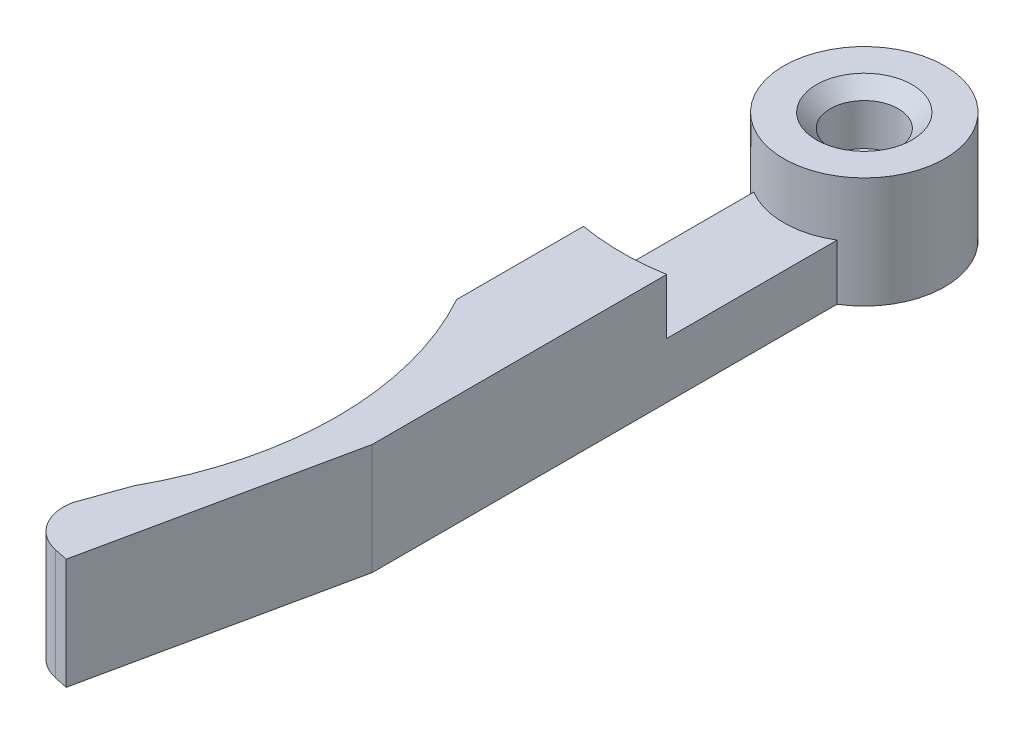
ISO-10303-21;
HEADER;
FILE_DESCRIPTION(('STEP AP214'),'2;1');
FILE_NAME('part.step','',(''),(''),'','','');
FILE_SCHEMA(('AUTOMOTIVE_DESIGN { 1 0 10303 214 1 1 1 1 }'));
ENDSEC;
DATA;
#1=APPLICATION_CONTEXT('core data for automotive mechanical design processes');
#2=APPLICATION_PROTOCOL_DEFINITION('international standard','automotive_design',2000,#1);
#3=PRODUCT_CONTEXT('',#1,'mechanical');
#4=PRODUCT('Part','Part','',(#3));
#5=PRODUCT_RELATED_PRODUCT_CATEGORY('part','',(#4));
#6=PRODUCT_DEFINITION_FORMATION('','',#4);
#7=PRODUCT_DEFINITION_CONTEXT('part definition',#1,'design');
#8=PRODUCT_DEFINITION('design','',#6,#7);
#9=PRODUCT_DEFINITION_SHAPE('','',#8);
#10=(LENGTH_UNIT() NAMED_UNIT(*) SI_UNIT(.MILLI.,.METRE.));
#11=(NAMED_UNIT(*) PLANE_ANGLE_UNIT() SI_UNIT($,.RADIAN.));
#12=(NAMED_UNIT(*) SI_UNIT($,.STERADIAN.) SOLID_ANGLE_UNIT());
#13=UNCERTAINTY_MEASURE_WITH_UNIT(LENGTH_MEASURE(1.E-05),#10,'distance_accuracy_value','');
#14=(GEOMETRIC_REPRESENTATION_CONTEXT(3) GLOBAL_UNCERTAINTY_ASSIGNED_CONTEXT((#13)) GLOBAL_UNIT_ASSIGNED_CONTEXT((#10,
#11,#12)) REPRESENTATION_CONTEXT('',''));
#15=CARTESIAN_POINT('',(0.,0.,0.));
#16=DIRECTION('',(0.,0.,1.));
#17=DIRECTION('',(1.,0.,0.));
#18=AXIS2_PLACEMENT_3D('',#15,#16,#17);
#19=CARTESIAN_POINT('',(0.,8.,0.));
#20=DIRECTION('',(0.,1.,0.));
#21=DIRECTION('',(0.,0.,-1.));
#22=AXIS2_PLACEMENT_3D('',#19,#20,#21);
#23=PLANE('',#22);
#24=CARTESIAN_POINT('',(0.,8.,0.));
#25=DIRECTION('',(0.,1.,0.));
#26=DIRECTION('',(0.,0.,1.));
#27=AXIS2_PLACEMENT_3D('',#24,#25,#26);
#28=CIRCLE('',#27,3.45);
#29=CARTESIAN_POINT('',(0.,8.,3.44999999999998));
#30=VERTEX_POINT('',#29);
#31=EDGE_CURVE('E54',#30,#30,#28,.F.);
#32=ORIENTED_EDGE('',*,*,#31,.T.);
#33=EDGE_LOOP('',(#32));
#34=FACE_BOUND('',#33,.T.);
#35=CARTESIAN_POINT('',(0.,8.,0.));
#36=DIRECTION('',(0.,-1.,0.));
#37=DIRECTION('',(0.,0.,-1.));
#38=AXIS2_PLACEMENT_3D('',#35,#36,#37);
#39=CIRCLE('',#38,5.8);
#40=CARTESIAN_POINT('',(0.,8.,-5.8));
#41=VERTEX_POINT('',#40);
#42=EDGE_CURVE('E172',#41,#41,#39,.T.);
#43=ORIENTED_EDGE('',*,*,#42,.F.);
#44=EDGE_LOOP('',(#43));
#45=FACE_BOUND('',#44,.T.);
#46=ADVANCED_FACE('F45',(#34,#45),#23,.T.);
#47=CARTESIAN_POINT('',(0.,-0.00100000000000013,0.));
#48=DIRECTION('',(0.,1.,0.));
#49=DIRECTION('',(0.,0.,-1.));
#50=AXIS2_PLACEMENT_3D('',#47,#48,#49);
#51=CYLINDRICAL_SURFACE('',#50,1.75);
#52=CARTESIAN_POINT('',(0.,4.,0.));
#53=DIRECTION('',(0.,-1.,0.));
#54=DIRECTION('',(0.,0.,-1.));
#55=AXIS2_PLACEMENT_3D('',#52,#53,#54);
#56=CIRCLE('',#55,1.75);
#57=CARTESIAN_POINT('',(0.,4.,-1.75000000000002));
#58=VERTEX_POINT('',#57);
#59=EDGE_CURVE('E190',#58,#58,#56,.T.);
#60=ORIENTED_EDGE('',*,*,#59,.F.);
#61=EDGE_LOOP('',(#60));
#62=FACE_BOUND('',#61,.T.);
#63=CARTESIAN_POINT('',(0.,2.5,0.));
#64=DIRECTION('',(0.,1.,0.));
#65=DIRECTION('',(0.,0.,1.));
#66=AXIS2_PLACEMENT_3D('',#63,#64,#65);
#67=CIRCLE('',#66,1.75);
#68=CARTESIAN_POINT('',(0.,2.5,1.74999999999998));
#69=VERTEX_POINT('',#68);
#70=EDGE_CURVE('E188',#69,#69,#67,.F.);
#71=ORIENTED_EDGE('',*,*,#70,.T.);
#72=EDGE_LOOP('',(#71));
#73=FACE_BOUND('',#72,.T.);
#74=ADVANCED_FACE('F209',(#62,#73),#51,.F.);
#75=CARTESIAN_POINT('',(0.,8.,0.));
#76=DIRECTION('',(0.,-1.,0.));
#77=DIRECTION('',(0.,0.,1.));
#78=AXIS2_PLACEMENT_3D('',#75,#76,#77);
#79=CYLINDRICAL_SURFACE('',#78,5.8);
#80=DIRECTION('',(0.,-1.,0.));
#81=VECTOR('',#80,1.);
#82=CARTESIAN_POINT('',(2.99999999999999,8.,4.96386945839635));
#83=LINE('',#82,#81);
#84=CARTESIAN_POINT('',(2.99999999999999,4.,4.96386945839635));
#85=VERTEX_POINT('',#84);
#86=CARTESIAN_POINT('',(2.99999999999999,0.,4.96386945839635));
#87=VERTEX_POINT('',#86);
#88=EDGE_CURVE('E185',#85,#87,#83,.T.);
#89=ORIENTED_EDGE('',*,*,#88,.T.);
#90=CARTESIAN_POINT('',(0.,0.,0.));
#91=DIRECTION('',(0.,-1.,0.));
#92=DIRECTION('',(0.,0.,-1.));
#93=AXIS2_PLACEMENT_3D('',#90,#91,#92);
#94=CIRCLE('',#93,5.8);
#95=CARTESIAN_POINT('',(-2.99999999999999,0.,4.96386945839635));
#96=VERTEX_POINT('',#95);
#97=EDGE_CURVE('E154',#96,#87,#94,.T.);
#98=ORIENTED_EDGE('',*,*,#97,.F.);
#99=DIRECTION('',(0.,-1.,0.));
#100=VECTOR('',#99,1.);
#101=CARTESIAN_POINT('',(-2.99999999999999,8.,4.96386945839635));
#102=LINE('',#101,#100);
#103=CARTESIAN_POINT('',(-2.99999999999999,4.,4.96386945839635));
#104=VERTEX_POINT('',#103);
#105=EDGE_CURVE('E153',#104,#96,#102,.T.);
#106=ORIENTED_EDGE('',*,*,#105,.F.);
#107=CARTESIAN_POINT('',(0.,4.,0.));
#108=DIRECTION('',(0.,1.,0.));
#109=DIRECTION('',(0.,0.,1.));
#110=AXIS2_PLACEMENT_3D('',#107,#108,#109);
#111=CIRCLE('',#110,5.80000000000002);
#112=EDGE_CURVE('E273',#104,#85,#111,.T.);
#113=ORIENTED_EDGE('',*,*,#112,.T.);
#114=EDGE_LOOP('',(#89,#98,#106,#113));
#115=FACE_BOUND('',#114,.T.);
#116=ORIENTED_EDGE('',*,*,#42,.T.);
#117=EDGE_LOOP('',(#116));
#118=FACE_BOUND('',#117,.T.);
#119=ADVANCED_FACE('F214',(#115,#118),#79,.T.);
#120=CARTESIAN_POINT('',(3.,8.,38.4638694583963));
#121=DIRECTION('',(-1.,0.,0.));
#122=DIRECTION('',(0.,0.,-1.));
#123=AXIS2_PLACEMENT_3D('',#120,#121,#122);
#124=PLANE('',#123);
#125=DIRECTION('',(0.,0.,1.));
#126=VECTOR('',#125,1.);
#127=CARTESIAN_POINT('',(3.,8.,38.4638694583963));
#128=LINE('',#127,#126);
#129=CARTESIAN_POINT('',(3.,8.,17.2409396495667));
#130=VERTEX_POINT('',#129);
#131=CARTESIAN_POINT('',(3.,8.,38.4638694583963));
#132=VERTEX_POINT('',#131);
#133=EDGE_CURVE('E263',#130,#132,#128,.T.);
#134=ORIENTED_EDGE('',*,*,#133,.T.);
#135=DIRECTION('',(0.,-1.,0.));
#136=VECTOR('',#135,1.);
#137=CARTESIAN_POINT('',(3.,8.,38.4638694583963));
#138=LINE('',#137,#136);
#139=CARTESIAN_POINT('',(3.,0.,38.4638694583963));
#140=VERTEX_POINT('',#139);
#141=EDGE_CURVE('E182',#132,#140,#138,.T.);
#142=ORIENTED_EDGE('',*,*,#141,.T.);
#143=DIRECTION('',(0.,0.,1.));
#144=VECTOR('',#143,1.);
#145=CARTESIAN_POINT('',(3.,0.,38.4638694583963));
#146=LINE('',#145,#144);
#147=EDGE_CURVE('E156',#87,#140,#146,.T.);
#148=ORIENTED_EDGE('',*,*,#147,.F.);
#149=ORIENTED_EDGE('',*,*,#88,.F.);
#150=DIRECTION('',(0.,0.,1.));
#151=VECTOR('',#150,1.);
#152=CARTESIAN_POINT('',(2.99999999999999,4.,4.96386945839635));
#153=LINE('',#152,#151);
#154=CARTESIAN_POINT('',(2.99999999999999,4.,17.2409396495667));
#155=VERTEX_POINT('',#154);
#156=EDGE_CURVE('E286',#85,#155,#153,.T.);
#157=ORIENTED_EDGE('',*,*,#156,.T.);
#158=DIRECTION('',(0.,1.,0.));
#159=VECTOR('',#158,1.);
#160=CARTESIAN_POINT('',(2.99999999999999,4.,17.2409396495667));
#161=LINE('',#160,#159);
#162=EDGE_CURVE('E271',#155,#130,#161,.T.);
#163=ORIENTED_EDGE('',*,*,#162,.T.);
#164=EDGE_LOOP('',(#134,#142,#148,#149,#157,#163));
#165=FACE_BOUND('',#164,.T.);
#166=ADVANCED_FACE('F249',(#165),#124,.F.);
#167=CARTESIAN_POINT('',(-0.867157449210331,8.,56.6574148320451));
#168=DIRECTION('',(-0.978147600733806,0.,-0.20791169081776));
#169=DIRECTION('',(0.20791169081776,0.,-0.978147600733806));
#170=AXIS2_PLACEMENT_3D('',#167,#168,#169);
#171=PLANE('',#170);
#172=DIRECTION('',(-0.20791169081776,0.,0.978147600733805));
#173=VECTOR('',#172,1.);
#174=CARTESIAN_POINT('',(-0.867157449210331,0.,56.6574148320451));
#175=LINE('',#174,#173);
#176=CARTESIAN_POINT('',(-0.867157449210331,0.,56.6574148320451));
#177=VERTEX_POINT('',#176);
#178=EDGE_CURVE('E160',#140,#177,#175,.T.);
#179=ORIENTED_EDGE('',*,*,#178,.F.);
#180=ORIENTED_EDGE('',*,*,#141,.F.);
#181=DIRECTION('',(-0.20791169081776,0.,0.978147600733805));
#182=VECTOR('',#181,1.);
#183=CARTESIAN_POINT('',(-0.867157449210331,8.,56.6574148320451));
#184=LINE('',#183,#182);
#185=CARTESIAN_POINT('',(-0.867157449210331,8.,56.6574148320451));
#186=VERTEX_POINT('',#185);
#187=EDGE_CURVE('E110',#132,#186,#184,.T.);
#188=ORIENTED_EDGE('',*,*,#187,.T.);
#189=DIRECTION('',(0.,-1.,0.));
#190=VECTOR('',#189,1.);
#191=CARTESIAN_POINT('',(-0.867157449210331,8.,56.6574148320451));
#192=LINE('',#191,#190);
#193=EDGE_CURVE('E179',#186,#177,#192,.T.);
#194=ORIENTED_EDGE('',*,*,#193,.T.);
#195=EDGE_LOOP('',(#179,#180,#188,#194));
#196=FACE_BOUND('',#195,.T.);
#197=ADVANCED_FACE('F245',(#196),#171,.F.);
#198=CARTESIAN_POINT('',(-1.84530504994414,8.,56.4495031412274));
#199=DIRECTION('',(0.207911690817762,0.,-0.978147600733805));
#200=DIRECTION('',(0.978147600733805,0.,0.207911690817762));
#201=AXIS2_PLACEMENT_3D('',#198,#199,#200);
#202=PLANE('',#201);
#203=DIRECTION('',(-0.978147600733805,0.,-0.207911690817762));
#204=VECTOR('',#203,1.);
#205=CARTESIAN_POINT('',(-1.84530504994414,0.,56.4495031412274));
#206=LINE('',#205,#204);
#207=CARTESIAN_POINT('',(-1.84530504994414,0.,56.4495031412274));
#208=VERTEX_POINT('',#207);
#209=EDGE_CURVE('E163',#177,#208,#206,.T.);
#210=ORIENTED_EDGE('',*,*,#209,.F.);
#211=ORIENTED_EDGE('',*,*,#193,.F.);
#212=DIRECTION('',(-0.978147600733805,0.,-0.207911690817762));
#213=VECTOR('',#212,1.);
#214=CARTESIAN_POINT('',(-1.84530504994414,8.,56.4495031412274));
#215=LINE('',#214,#213);
#216=CARTESIAN_POINT('',(-1.84530504994414,8.,56.4495031412274));
#217=VERTEX_POINT('',#216);
#218=EDGE_CURVE('E146',#186,#217,#215,.T.);
#219=ORIENTED_EDGE('',*,*,#218,.T.);
#220=DIRECTION('',(0.,-1.,0.));
#221=VECTOR('',#220,1.);
#222=CARTESIAN_POINT('',(-1.84530504994414,8.,56.4495031412274));
#223=LINE('',#222,#221);
#224=EDGE_CURVE('E140',#217,#208,#223,.T.);
#225=ORIENTED_EDGE('',*,*,#224,.T.);
#226=EDGE_LOOP('',(#210,#211,#219,#225));
#227=FACE_BOUND('',#226,.T.);
#228=ADVANCED_FACE('F242',(#227),#202,.F.);
#229=CARTESIAN_POINT('',(-1.22156997749086,8.,53.515060339026));
#230=DIRECTION('',(0.,-1.,0.));
#231=DIRECTION('',(0.,0.,1.));
#232=AXIS2_PLACEMENT_3D('',#229,#230,#231);
#233=CYLINDRICAL_SURFACE('',#232,3.);
#234=CARTESIAN_POINT('',(-1.22156997749086,0.,53.515060339026));
#235=DIRECTION('',(0.,-1.,0.));
#236=DIRECTION('',(0.,0.,1.));
#237=AXIS2_PLACEMENT_3D('',#234,#235,#236);
#238=CIRCLE('',#237,3.);
#239=CARTESIAN_POINT('',(-4.14041417555798,0.,52.8219885192194));
#240=VERTEX_POINT('',#239);
#241=EDGE_CURVE('E166',#208,#240,#238,.T.);
#242=ORIENTED_EDGE('',*,*,#241,.F.);
#243=ORIENTED_EDGE('',*,*,#224,.F.);
#244=CARTESIAN_POINT('',(-1.22156997749086,8.,53.515060339026));
#245=DIRECTION('',(0.,-1.,0.));
#246=DIRECTION('',(0.,0.,1.));
#247=AXIS2_PLACEMENT_3D('',#244,#245,#246);
#248=CIRCLE('',#247,3.);
#249=CARTESIAN_POINT('',(-4.14041417555798,8.,52.8219885192194));
#250=VERTEX_POINT('',#249);
#251=EDGE_CURVE('E125',#217,#250,#248,.T.);
#252=ORIENTED_EDGE('',*,*,#251,.T.);
#253=DIRECTION('',(0.,-1.,0.));
#254=VECTOR('',#253,1.);
#255=CARTESIAN_POINT('',(-4.14041417555798,8.,52.8219885192194));
#256=LINE('',#255,#254);
#257=EDGE_CURVE('E134',#250,#240,#256,.T.);
#258=ORIENTED_EDGE('',*,*,#257,.T.);
#259=EDGE_LOOP('',(#242,#243,#252,#258));
#260=FACE_BOUND('',#259,.T.);
#261=ADVANCED_FACE('F143',(#260),#233,.T.);
#262=CARTESIAN_POINT('',(-4.14041417555798,8.,52.8219885192194));
#263=DIRECTION('',(0.942070141352118,0.,0.33541593398764));
#264=DIRECTION('',(-0.33541593398764,0.,0.942070141352118));
#265=AXIS2_PLACEMENT_3D('',#262,#263,#264);
#266=PLANE('',#265);
#267=DIRECTION('',(0.33541593398764,0.,-0.942070141352118));
#268=VECTOR('',#267,1.);
#269=CARTESIAN_POINT('',(-4.14041417555798,0.,52.8219885192194));
#270=LINE('',#269,#268);
#271=CARTESIAN_POINT('',(-3.,0.,49.6189500386222));
#272=VERTEX_POINT('',#271);
#273=EDGE_CURVE('E137',#240,#272,#270,.T.);
#274=ORIENTED_EDGE('',*,*,#273,.F.);
#275=ORIENTED_EDGE('',*,*,#257,.F.);
#276=DIRECTION('',(0.33541593398764,0.,-0.942070141352118));
#277=VECTOR('',#276,1.);
#278=CARTESIAN_POINT('',(-4.14041417555798,8.,52.8219885192194));
#279=LINE('',#278,#277);
#280=CARTESIAN_POINT('',(-3.,8.,49.6189500386222));
#281=VERTEX_POINT('',#280);
#282=EDGE_CURVE('E121',#250,#281,#279,.T.);
#283=ORIENTED_EDGE('',*,*,#282,.T.);
#284=DIRECTION('',(0.,-1.,0.));
#285=VECTOR('',#284,1.);
#286=CARTESIAN_POINT('',(-3.,8.,49.6189500386222));
#287=LINE('',#286,#285);
#288=EDGE_CURVE('E141',#281,#272,#287,.T.);
#289=ORIENTED_EDGE('',*,*,#288,.T.);
#290=EDGE_LOOP('',(#274,#275,#283,#289));
#291=FACE_BOUND('',#290,.T.);
#292=ADVANCED_FACE('F135',(#291),#266,.F.);
#293=CARTESIAN_POINT('',(-24.,8.,38.));
#294=DIRECTION('',(0.,-1.,0.));
#295=DIRECTION('',(0.,0.,1.));
#296=AXIS2_PLACEMENT_3D('',#293,#294,#295);
#297=CYLINDRICAL_SURFACE('',#296,24.);
#298=CARTESIAN_POINT('',(-24.,0.,38.));
#299=DIRECTION('',(0.,1.,0.));
#300=DIRECTION('',(0.,0.,1.));
#301=AXIS2_PLACEMENT_3D('',#298,#299,#300);
#302=CIRCLE('',#301,24.);
#303=CARTESIAN_POINT('',(-2.99999999999999,0.,26.3810499613777));
#304=VERTEX_POINT('',#303);
#305=EDGE_CURVE('E169',#272,#304,#302,.T.);
#306=ORIENTED_EDGE('',*,*,#305,.F.);
#307=ORIENTED_EDGE('',*,*,#288,.F.);
#308=CARTESIAN_POINT('',(-24.,8.,38.));
#309=DIRECTION('',(0.,1.,0.));
#310=DIRECTION('',(0.,0.,1.));
#311=AXIS2_PLACEMENT_3D('',#308,#309,#310);
#312=CIRCLE('',#311,24.);
#313=CARTESIAN_POINT('',(-2.99999999999999,8.,26.3810499613777));
#314=VERTEX_POINT('',#313);
#315=EDGE_CURVE('E128',#281,#314,#312,.T.);
#316=ORIENTED_EDGE('',*,*,#315,.T.);
#317=DIRECTION('',(0.,-1.,0.));
#318=VECTOR('',#317,1.);
#319=CARTESIAN_POINT('',(-2.99999999999999,8.,26.3810499613777));
#320=LINE('',#319,#318);
#321=EDGE_CURVE('E174',#314,#304,#320,.T.);
#322=ORIENTED_EDGE('',*,*,#321,.T.);
#323=EDGE_LOOP('',(#306,#307,#316,#322));
#324=FACE_BOUND('',#323,.T.);
#325=ADVANCED_FACE('F228',(#324),#297,.F.);
#326=CARTESIAN_POINT('',(-2.99999999999999,8.,26.3810499613777));
#327=DIRECTION('',(1.,0.,0.));
#328=DIRECTION('',(0.,0.,1.));
#329=AXIS2_PLACEMENT_3D('',#326,#327,#328);
#330=PLANE('',#329);
#331=DIRECTION('',(0.,0.,-1.));
#332=VECTOR('',#331,1.);
#333=CARTESIAN_POINT('',(-2.99999999999999,4.,4.96386945839635));
#334=LINE('',#333,#332);
#335=CARTESIAN_POINT('',(-2.99999999999999,4.,17.2409396495666));
#336=VERTEX_POINT('',#335);
#337=EDGE_CURVE('E291',#336,#104,#334,.T.);
#338=ORIENTED_EDGE('',*,*,#337,.T.);
#339=ORIENTED_EDGE('',*,*,#105,.T.);
#340=DIRECTION('',(0.,0.,-1.));
#341=VECTOR('',#340,1.);
#342=CARTESIAN_POINT('',(-2.99999999999999,0.,26.3810499613777));
#343=LINE('',#342,#341);
#344=EDGE_CURVE('E102',#304,#96,#343,.T.);
#345=ORIENTED_EDGE('',*,*,#344,.F.);
#346=ORIENTED_EDGE('',*,*,#321,.F.);
#347=DIRECTION('',(0.,0.,-1.));
#348=VECTOR('',#347,1.);
#349=CARTESIAN_POINT('',(-2.99999999999999,8.,26.3810499613777));
#350=LINE('',#349,#348);
#351=CARTESIAN_POINT('',(-2.99999999999999,8.,17.2409396495666));
#352=VERTEX_POINT('',#351);
#353=EDGE_CURVE('E69',#314,#352,#350,.T.);
#354=ORIENTED_EDGE('',*,*,#353,.T.);
#355=DIRECTION('',(0.,1.,0.));
#356=VECTOR('',#355,1.);
#357=CARTESIAN_POINT('',(-2.99999999999999,4.,17.2409396495666));
#358=LINE('',#357,#356);
#359=EDGE_CURVE('E277',#336,#352,#358,.T.);
#360=ORIENTED_EDGE('',*,*,#359,.F.);
#361=EDGE_LOOP('',(#338,#339,#345,#346,#354,#360));
#362=FACE_BOUND('',#361,.T.);
#363=ADVANCED_FACE('F221',(#362),#330,.F.);
#364=CARTESIAN_POINT('',(0.,8.,0.));
#365=DIRECTION('',(0.,-1.,0.));
#366=DIRECTION('',(0.,0.,1.));
#367=AXIS2_PLACEMENT_3D('',#364,#365,#366);
#368=CIRCLE('',#367,17.5);
#369=EDGE_CURVE('E61',#130,#352,#368,.T.);
#370=ORIENTED_EDGE('',*,*,#369,.T.);
#371=ORIENTED_EDGE('',*,*,#353,.F.);
#372=ORIENTED_EDGE('',*,*,#315,.F.);
#373=ORIENTED_EDGE('',*,*,#282,.F.);
#374=ORIENTED_EDGE('',*,*,#251,.F.);
#375=ORIENTED_EDGE('',*,*,#218,.F.);
#376=ORIENTED_EDGE('',*,*,#187,.F.);
#377=ORIENTED_EDGE('',*,*,#133,.F.);
#378=EDGE_LOOP('',(#370,#371,#372,#373,#374,#375,#376,#377));
#379=FACE_BOUND('',#378,.T.);
#380=ADVANCED_FACE('F123',(#379),#23,.T.);
#381=CARTESIAN_POINT('',(0.,0.,0.));
#382=DIRECTION('',(0.,1.,0.));
#383=DIRECTION('',(0.,0.,-1.));
#384=AXIS2_PLACEMENT_3D('',#381,#382,#383);
#385=PLANE('',#384);
#386=CARTESIAN_POINT('',(0.,0.,0.));
#387=DIRECTION('',(0.,1.,0.));
#388=DIRECTION('',(0.,0.,1.));
#389=AXIS2_PLACEMENT_3D('',#386,#387,#388);
#390=CIRCLE('',#389,3.75);
#391=CARTESIAN_POINT('',(0.,0.,3.74999999999998));
#392=VERTEX_POINT('',#391);
#393=EDGE_CURVE('E282',#392,#392,#390,.T.);
#394=ORIENTED_EDGE('',*,*,#393,.T.);
#395=EDGE_LOOP('',(#394));
#396=FACE_BOUND('',#395,.T.);
#397=ORIENTED_EDGE('',*,*,#97,.T.);
#398=ORIENTED_EDGE('',*,*,#147,.T.);
#399=ORIENTED_EDGE('',*,*,#178,.T.);
#400=ORIENTED_EDGE('',*,*,#209,.T.);
#401=ORIENTED_EDGE('',*,*,#241,.T.);
#402=ORIENTED_EDGE('',*,*,#273,.T.);
#403=ORIENTED_EDGE('',*,*,#305,.T.);
#404=ORIENTED_EDGE('',*,*,#344,.T.);
#405=EDGE_LOOP('',(#397,#398,#399,#400,#401,#402,#403,#404));
#406=FACE_BOUND('',#405,.T.);
#407=ADVANCED_FACE('F220',(#396,#406),#385,.F.);
#408=CARTESIAN_POINT('',(0.,4.,0.));
#409=DIRECTION('',(0.,1.,0.));
#410=DIRECTION('',(0.,0.,-1.));
#411=AXIS2_PLACEMENT_3D('',#408,#409,#410);
#412=CYLINDRICAL_SURFACE('',#411,2.45);
#413=CARTESIAN_POINT('',(0.,6.99999999999999,0.));
#414=DIRECTION('',(0.,1.,0.));
#415=DIRECTION('',(0.,0.,1.));
#416=AXIS2_PLACEMENT_3D('',#413,#414,#415);
#417=CIRCLE('',#416,2.45);
#418=CARTESIAN_POINT('',(0.,6.99999999999999,2.44999999999998));
#419=VERTEX_POINT('',#418);
#420=EDGE_CURVE('E11',#419,#419,#417,.T.);
#421=ORIENTED_EDGE('',*,*,#420,.T.);
#422=EDGE_LOOP('',(#421));
#423=FACE_BOUND('',#422,.T.);
#424=CARTESIAN_POINT('',(0.,4.,0.));
#425=DIRECTION('',(0.,-1.,0.));
#426=DIRECTION('',(0.,0.,-1.));
#427=AXIS2_PLACEMENT_3D('',#424,#425,#426);
#428=CIRCLE('',#427,2.45);
#429=CARTESIAN_POINT('',(0.,4.,-2.45000000000002));
#430=VERTEX_POINT('',#429);
#431=EDGE_CURVE('E157',#430,#430,#428,.T.);
#432=ORIENTED_EDGE('',*,*,#431,.T.);
#433=EDGE_LOOP('',(#432));
#434=FACE_BOUND('',#433,.T.);
#435=ADVANCED_FACE('F226',(#423,#434),#412,.F.);
#436=CARTESIAN_POINT('',(0.,4.,0.));
#437=DIRECTION('',(0.,1.,0.));
#438=DIRECTION('',(0.,0.,-1.));
#439=AXIS2_PLACEMENT_3D('',#436,#437,#438);
#440=PLANE('',#439);
#441=ORIENTED_EDGE('',*,*,#59,.T.);
#442=EDGE_LOOP('',(#441));
#443=FACE_BOUND('',#442,.T.);
#444=ORIENTED_EDGE('',*,*,#431,.F.);
#445=EDGE_LOOP('',(#444));
#446=FACE_BOUND('',#445,.T.);
#447=ADVANCED_FACE('F309',(#443,#446),#440,.T.);
#448=CARTESIAN_POINT('',(0.,2.5,0.));
#449=DIRECTION('',(0.,-1.,0.));
#450=DIRECTION('',(0.,0.,1.));
#451=AXIS2_PLACEMENT_3D('',#448,#449,#450);
#452=PLANE('',#451);
#453=CARTESIAN_POINT('',(0.,2.5,0.));
#454=DIRECTION('',(0.,1.,0.));
#455=DIRECTION('',(0.,0.,1.));
#456=AXIS2_PLACEMENT_3D('',#453,#454,#455);
#457=CIRCLE('',#456,3.75);
#458=CARTESIAN_POINT('',(0.,2.5,3.74999999999998));
#459=VERTEX_POINT('',#458);
#460=EDGE_CURVE('E191',#459,#459,#457,.T.);
#461=ORIENTED_EDGE('',*,*,#460,.F.);
#462=EDGE_LOOP('',(#461));
#463=FACE_BOUND('',#462,.T.);
#464=ORIENTED_EDGE('',*,*,#70,.F.);
#465=EDGE_LOOP('',(#464));
#466=FACE_BOUND('',#465,.T.);
#467=ADVANCED_FACE('F311',(#463,#466),#452,.T.);
#468=CARTESIAN_POINT('',(0.,2.5,0.));
#469=DIRECTION('',(0.,-1.,0.));
#470=DIRECTION('',(0.,0.,1.));
#471=AXIS2_PLACEMENT_3D('',#468,#469,#470);
#472=CYLINDRICAL_SURFACE('',#471,3.75);
#473=ORIENTED_EDGE('',*,*,#460,.T.);
#474=EDGE_LOOP('',(#473));
#475=FACE_BOUND('',#474,.T.);
#476=ORIENTED_EDGE('',*,*,#393,.F.);
#477=EDGE_LOOP('',(#476));
#478=FACE_BOUND('',#477,.T.);
#479=ADVANCED_FACE('F316',(#475,#478),#472,.F.);
#480=CARTESIAN_POINT('',(0.,4.,0.));
#481=DIRECTION('',(0.,1.,0.));
#482=DIRECTION('',(0.,0.,-1.));
#483=AXIS2_PLACEMENT_3D('',#480,#481,#482);
#484=CYLINDRICAL_SURFACE('',#483,17.5);
#485=ORIENTED_EDGE('',*,*,#369,.F.);
#486=ORIENTED_EDGE('',*,*,#162,.F.);
#487=CARTESIAN_POINT('',(0.,4.,0.));
#488=DIRECTION('',(0.,-1.,0.));
#489=DIRECTION('',(0.,0.,1.));
#490=AXIS2_PLACEMENT_3D('',#487,#488,#489);
#491=CIRCLE('',#490,17.5);
#492=EDGE_CURVE('E280',#155,#336,#491,.T.);
#493=ORIENTED_EDGE('',*,*,#492,.T.);
#494=ORIENTED_EDGE('',*,*,#359,.T.);
#495=EDGE_LOOP('',(#485,#486,#493,#494));
#496=FACE_BOUND('',#495,.T.);
#497=ADVANCED_FACE('F204',(#496),#484,.F.);
#498=CARTESIAN_POINT('',(0.,4.,0.));
#499=DIRECTION('',(0.,-1.,0.));
#500=DIRECTION('',(0.,0.,1.));
#501=AXIS2_PLACEMENT_3D('',#498,#499,#500);
#502=PLANE('',#501);
#503=ORIENTED_EDGE('',*,*,#112,.F.);
#504=ORIENTED_EDGE('',*,*,#337,.F.);
#505=ORIENTED_EDGE('',*,*,#492,.F.);
#506=ORIENTED_EDGE('',*,*,#156,.F.);
#507=EDGE_LOOP('',(#503,#504,#505,#506));
#508=FACE_BOUND('',#507,.T.);
#509=ADVANCED_FACE('F198',(#508),#502,.F.);
#510=CARTESIAN_POINT('',(0.,8.,0.));
#511=DIRECTION('',(0.,1.,0.));
#512=DIRECTION('',(0.,0.,1.));
#513=AXIS2_PLACEMENT_3D('',#510,#511,#512);
#514=CONICAL_SURFACE('',#513,3.45,0.785398163397446);
#515=ORIENTED_EDGE('',*,*,#420,.F.);
#516=EDGE_LOOP('',(#515));
#517=FACE_BOUND('',#516,.T.);
#518=ORIENTED_EDGE('',*,*,#31,.F.);
#519=EDGE_LOOP('',(#518));
#520=FACE_BOUND('',#519,.T.);
#521=ADVANCED_FACE('F48',(#517,#520),#514,.F.);
#522=CLOSED_SHELL('',(#46,#74,#119,#166,#197,#228,#261,#292,#325,#363,#380,#407,#435,#447,#467,
#479,#497,#509,#521));
#523=MANIFOLD_SOLID_BREP('B2',#522);
#524=ADVANCED_BREP_SHAPE_REPRESENTATION('',(#18,#523),#14);
#525=SHAPE_DEFINITION_REPRESENTATION(#9,#524);
ENDSEC;
END-ISO-10303-21;
